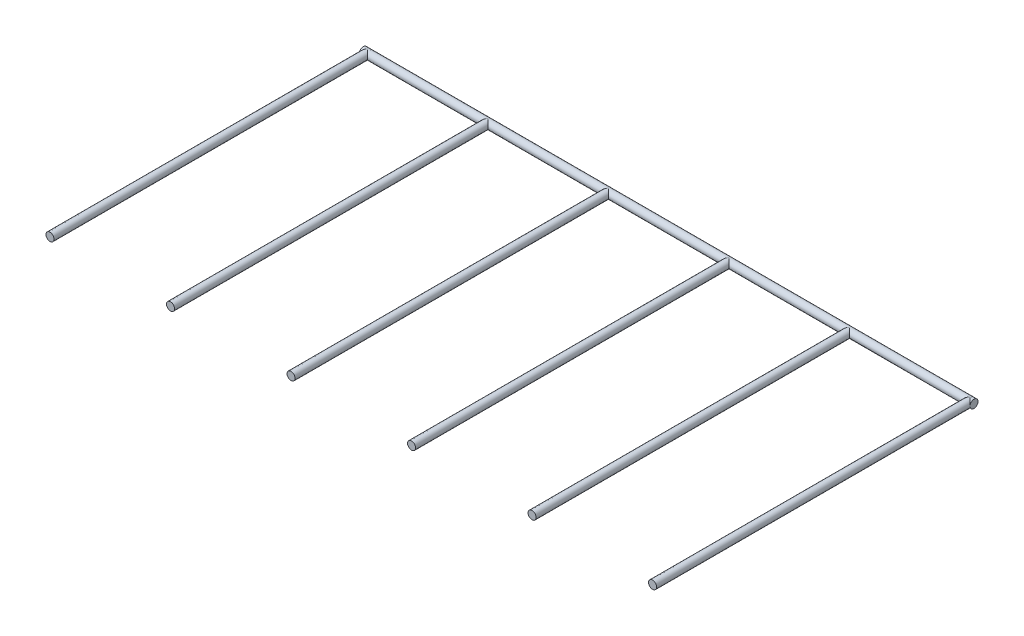
ISO-10303-21;
HEADER;
FILE_DESCRIPTION(('STEP AP214'),'2;1');
FILE_NAME('part.step','',(''),(''),'','','');
FILE_SCHEMA(('AUTOMOTIVE_DESIGN { 1 0 10303 214 1 1 1 1 }'));
ENDSEC;
DATA;
#1=APPLICATION_CONTEXT('core data for automotive mechanical design processes');
#2=APPLICATION_PROTOCOL_DEFINITION('international standard','automotive_design',2000,#1);
#3=PRODUCT_CONTEXT('',#1,'mechanical');
#4=PRODUCT('Part','Part','',(#3));
#5=PRODUCT_RELATED_PRODUCT_CATEGORY('part','',(#4));
#6=PRODUCT_DEFINITION_FORMATION('','',#4);
#7=PRODUCT_DEFINITION_CONTEXT('part definition',#1,'design');
#8=PRODUCT_DEFINITION('design','',#6,#7);
#9=PRODUCT_DEFINITION_SHAPE('','',#8);
#10=(LENGTH_UNIT() NAMED_UNIT(*) SI_UNIT(.MILLI.,.METRE.));
#11=(NAMED_UNIT(*) PLANE_ANGLE_UNIT() SI_UNIT($,.RADIAN.));
#12=(NAMED_UNIT(*) SI_UNIT($,.STERADIAN.) SOLID_ANGLE_UNIT());
#13=UNCERTAINTY_MEASURE_WITH_UNIT(LENGTH_MEASURE(1.E-05),#10,'distance_accuracy_value','');
#14=(GEOMETRIC_REPRESENTATION_CONTEXT(3) GLOBAL_UNCERTAINTY_ASSIGNED_CONTEXT((#13)) GLOBAL_UNIT_ASSIGNED_CONTEXT((#10,
#11,#12)) REPRESENTATION_CONTEXT('',''));
#15=CARTESIAN_POINT('',(0.,0.,0.));
#16=DIRECTION('',(0.,0.,1.));
#17=DIRECTION('',(1.,0.,0.));
#18=AXIS2_PLACEMENT_3D('',#15,#16,#17);
#19=CARTESIAN_POINT('',(120.65,0.,0.));
#20=DIRECTION('',(-1.,0.,0.));
#21=DIRECTION('',(0.,0.,1.));
#22=AXIS2_PLACEMENT_3D('',#19,#20,#21);
#23=CYLINDRICAL_SURFACE('',#22,1.5875);
#24=CARTESIAN_POINT('',(71.4375,0.,0.));
#25=DIRECTION('',(-0.707106781186547,0.,-0.707106781186548));
#26=DIRECTION('',(-0.707106781186547,0.,0.707106781186548));
#27=AXIS2_PLACEMENT_3D('',#24,#25,#26);
#28=ELLIPSE('',#27,2.24506403026729,1.5875);
#29=CARTESIAN_POINT('',(71.4375,1.5875,0.));
#30=VERTEX_POINT('',#29);
#31=CARTESIAN_POINT('',(71.4375,-1.5875,0.));
#32=VERTEX_POINT('',#31);
#33=EDGE_CURVE('E11',#30,#32,#28,.F.);
#34=ORIENTED_EDGE('',*,*,#33,.F.);
#35=CARTESIAN_POINT('',(71.4375,0.,0.));
#36=DIRECTION('',(-0.707106781186547,0.,0.707106781186548));
#37=DIRECTION('',(-0.707106781186547,0.,-0.707106781186548));
#38=AXIS2_PLACEMENT_3D('',#35,#36,#37);
#39=ELLIPSE('',#38,2.24506403026729,1.5875);
#40=EDGE_CURVE('E42',#32,#30,#39,.T.);
#41=ORIENTED_EDGE('',*,*,#40,.F.);
#42=EDGE_LOOP('',(#34,#41));
#43=FACE_BOUND('',#42,.T.);
#44=CARTESIAN_POINT('',(-23.8125,0.,0.));
#45=DIRECTION('',(-0.707106781186547,0.,-0.707106781186548));
#46=DIRECTION('',(-0.707106781186547,0.,0.707106781186548));
#47=AXIS2_PLACEMENT_3D('',#44,#45,#46);
#48=ELLIPSE('',#47,2.24506403026729,1.5875);
#49=CARTESIAN_POINT('',(-23.8125,1.5875,0.));
#50=VERTEX_POINT('',#49);
#51=CARTESIAN_POINT('',(-23.8124999999999,-1.5875,0.));
#52=VERTEX_POINT('',#51);
#53=EDGE_CURVE('E137',#50,#52,#48,.F.);
#54=ORIENTED_EDGE('',*,*,#53,.F.);
#55=CARTESIAN_POINT('',(-23.8125,0.,0.));
#56=DIRECTION('',(-0.707106781186547,0.,0.707106781186548));
#57=DIRECTION('',(-0.707106781186547,0.,-0.707106781186548));
#58=AXIS2_PLACEMENT_3D('',#55,#56,#57);
#59=ELLIPSE('',#58,2.24506403026729,1.5875);
#60=EDGE_CURVE('E134',#52,#50,#59,.T.);
#61=ORIENTED_EDGE('',*,*,#60,.F.);
#62=EDGE_LOOP('',(#54,#61));
#63=FACE_BOUND('',#62,.T.);
#64=CARTESIAN_POINT('',(-119.0625,0.,0.));
#65=DIRECTION('',(-0.707106781186547,0.,-0.707106781186548));
#66=DIRECTION('',(-0.707106781186547,0.,0.707106781186548));
#67=AXIS2_PLACEMENT_3D('',#64,#65,#66);
#68=ELLIPSE('',#67,2.24506403026729,1.5875);
#69=CARTESIAN_POINT('',(-119.0625,1.5875,0.));
#70=VERTEX_POINT('',#69);
#71=CARTESIAN_POINT('',(-120.65,0.,1.5875));
#72=VERTEX_POINT('',#71);
#73=EDGE_CURVE('E120',#70,#72,#68,.F.);
#74=ORIENTED_EDGE('',*,*,#73,.F.);
#75=CARTESIAN_POINT('',(-119.0625,0.,0.));
#76=DIRECTION('',(-0.707106781186547,0.,0.707106781186548));
#77=DIRECTION('',(-0.707106781186547,0.,-0.707106781186548));
#78=AXIS2_PLACEMENT_3D('',#75,#76,#77);
#79=ELLIPSE('',#78,2.24506403026729,1.5875);
#80=CARTESIAN_POINT('',(-119.0625,-1.5875,0.));
#81=VERTEX_POINT('',#80);
#82=EDGE_CURVE('E119',#81,#70,#79,.T.);
#83=ORIENTED_EDGE('',*,*,#82,.F.);
#84=EDGE_CURVE('E116',#72,#81,#68,.F.);
#85=ORIENTED_EDGE('',*,*,#84,.F.);
#86=CARTESIAN_POINT('',(-120.65,0.,0.));
#87=DIRECTION('',(1.,0.,0.));
#88=DIRECTION('',(0.,0.,-1.));
#89=AXIS2_PLACEMENT_3D('',#86,#87,#88);
#90=CIRCLE('',#89,1.5875);
#91=EDGE_CURVE('E126',#72,#72,#90,.T.);
#92=ORIENTED_EDGE('',*,*,#91,.T.);
#93=EDGE_LOOP('',(#74,#83,#85,#92));
#94=FACE_BOUND('',#93,.T.);
#95=CARTESIAN_POINT('',(-71.4375,0.,0.));
#96=DIRECTION('',(-0.707106781186547,0.,-0.707106781186548));
#97=DIRECTION('',(-0.707106781186547,0.,0.707106781186548));
#98=AXIS2_PLACEMENT_3D('',#95,#96,#97);
#99=ELLIPSE('',#98,2.24506403026729,1.5875);
#100=CARTESIAN_POINT('',(-71.4375,1.5875,0.));
#101=VERTEX_POINT('',#100);
#102=CARTESIAN_POINT('',(-71.4374999999999,-1.5875,0.));
#103=VERTEX_POINT('',#102);
#104=EDGE_CURVE('E131',#101,#103,#99,.F.);
#105=ORIENTED_EDGE('',*,*,#104,.F.);
#106=CARTESIAN_POINT('',(-71.4375,0.,0.));
#107=DIRECTION('',(-0.707106781186547,0.,0.707106781186548));
#108=DIRECTION('',(-0.707106781186547,0.,-0.707106781186548));
#109=AXIS2_PLACEMENT_3D('',#106,#107,#108);
#110=ELLIPSE('',#109,2.24506403026729,1.5875);
#111=EDGE_CURVE('E125',#103,#101,#110,.T.);
#112=ORIENTED_EDGE('',*,*,#111,.F.);
#113=EDGE_LOOP('',(#105,#112));
#114=FACE_BOUND('',#113,.T.);
#115=CARTESIAN_POINT('',(23.8125,0.,0.));
#116=DIRECTION('',(-0.707106781186547,0.,-0.707106781186548));
#117=DIRECTION('',(-0.707106781186547,0.,0.707106781186548));
#118=AXIS2_PLACEMENT_3D('',#115,#116,#117);
#119=ELLIPSE('',#118,2.24506403026729,1.5875);
#120=CARTESIAN_POINT('',(23.8125,1.5875,0.));
#121=VERTEX_POINT('',#120);
#122=CARTESIAN_POINT('',(23.8125,-1.5875,0.));
#123=VERTEX_POINT('',#122);
#124=EDGE_CURVE('E143',#121,#123,#119,.F.);
#125=ORIENTED_EDGE('',*,*,#124,.F.);
#126=CARTESIAN_POINT('',(23.8125,0.,0.));
#127=DIRECTION('',(-0.707106781186547,0.,0.707106781186548));
#128=DIRECTION('',(-0.707106781186547,0.,-0.707106781186548));
#129=AXIS2_PLACEMENT_3D('',#126,#127,#128);
#130=ELLIPSE('',#129,2.24506403026729,1.5875);
#131=EDGE_CURVE('E140',#123,#121,#130,.T.);
#132=ORIENTED_EDGE('',*,*,#131,.F.);
#133=EDGE_LOOP('',(#125,#132));
#134=FACE_BOUND('',#133,.T.);
#135=CARTESIAN_POINT('',(119.0625,0.,0.));
#136=DIRECTION('',(-0.707106781186547,0.,-0.707106781186548));
#137=DIRECTION('',(-0.707106781186547,0.,0.707106781186548));
#138=AXIS2_PLACEMENT_3D('',#135,#136,#137);
#139=ELLIPSE('',#138,2.24506403026729,1.5875);
#140=CARTESIAN_POINT('',(119.0625,1.5875,0.));
#141=VERTEX_POINT('',#140);
#142=CARTESIAN_POINT('',(119.0625,-1.5875,0.));
#143=VERTEX_POINT('',#142);
#144=EDGE_CURVE('E90',#141,#143,#139,.F.);
#145=ORIENTED_EDGE('',*,*,#144,.F.);
#146=CARTESIAN_POINT('',(119.0625,0.,0.));
#147=DIRECTION('',(-0.707106781186547,0.,0.707106781186548));
#148=DIRECTION('',(-0.707106781186547,0.,-0.707106781186548));
#149=AXIS2_PLACEMENT_3D('',#146,#147,#148);
#150=ELLIPSE('',#149,2.24506403026729,1.5875);
#151=CARTESIAN_POINT('',(120.65,0.,1.5875));
#152=VERTEX_POINT('',#151);
#153=EDGE_CURVE('E54',#152,#141,#150,.T.);
#154=ORIENTED_EDGE('',*,*,#153,.F.);
#155=CARTESIAN_POINT('',(120.65,0.,0.));
#156=DIRECTION('',(1.,0.,0.));
#157=DIRECTION('',(0.,0.,-1.));
#158=AXIS2_PLACEMENT_3D('',#155,#156,#157);
#159=CIRCLE('',#158,1.5875);
#160=EDGE_CURVE('E123',#152,#152,#159,.T.);
#161=ORIENTED_EDGE('',*,*,#160,.F.);
#162=EDGE_CURVE('E49',#143,#152,#150,.T.);
#163=ORIENTED_EDGE('',*,*,#162,.F.);
#164=EDGE_LOOP('',(#145,#154,#161,#163));
#165=FACE_BOUND('',#164,.T.);
#166=ADVANCED_FACE('F35',(#43,#63,#94,#114,#134,#165),#23,.T.);
#167=CARTESIAN_POINT('',(120.65,0.,0.));
#168=DIRECTION('',(1.,0.,0.));
#169=DIRECTION('',(0.,0.,-1.));
#170=AXIS2_PLACEMENT_3D('',#167,#168,#169);
#171=PLANE('',#170);
#172=ORIENTED_EDGE('',*,*,#160,.T.);
#173=EDGE_LOOP('',(#172));
#174=FACE_BOUND('',#173,.T.);
#175=ADVANCED_FACE('F151',(#174),#171,.T.);
#176=CARTESIAN_POINT('',(-120.65,0.,0.));
#177=DIRECTION('',(1.,0.,0.));
#178=DIRECTION('',(0.,0.,-1.));
#179=AXIS2_PLACEMENT_3D('',#176,#177,#178);
#180=PLANE('',#179);
#181=ORIENTED_EDGE('',*,*,#91,.F.);
#182=EDGE_LOOP('',(#181));
#183=FACE_BOUND('',#182,.T.);
#184=ADVANCED_FACE('F193',(#183),#180,.F.);
#185=CARTESIAN_POINT('',(-119.0625,0.,125.4125));
#186=DIRECTION('',(0.,0.,-1.));
#187=DIRECTION('',(-1.,0.,0.));
#188=AXIS2_PLACEMENT_3D('',#185,#186,#187);
#189=CYLINDRICAL_SURFACE('',#188,1.5875);
#190=CARTESIAN_POINT('',(-119.0625,0.,125.4125));
#191=DIRECTION('',(0.,0.,1.));
#192=DIRECTION('',(1.,0.,0.));
#193=AXIS2_PLACEMENT_3D('',#190,#191,#192);
#194=CIRCLE('',#193,1.5875);
#195=CARTESIAN_POINT('',(-117.475,0.,125.4125));
#196=VERTEX_POINT('',#195);
#197=EDGE_CURVE('E113',#196,#196,#194,.T.);
#198=ORIENTED_EDGE('',*,*,#197,.F.);
#199=EDGE_LOOP('',(#198));
#200=FACE_BOUND('',#199,.T.);
#201=ORIENTED_EDGE('',*,*,#82,.T.);
#202=ORIENTED_EDGE('',*,*,#73,.T.);
#203=ORIENTED_EDGE('',*,*,#84,.T.);
#204=EDGE_LOOP('',(#201,#202,#203));
#205=FACE_BOUND('',#204,.T.);
#206=ADVANCED_FACE('F189',(#200,#205),#189,.T.);
#207=CARTESIAN_POINT('',(-119.0625,0.,125.4125));
#208=DIRECTION('',(0.,0.,1.));
#209=DIRECTION('',(1.,0.,0.));
#210=AXIS2_PLACEMENT_3D('',#207,#208,#209);
#211=PLANE('',#210);
#212=ORIENTED_EDGE('',*,*,#197,.T.);
#213=EDGE_LOOP('',(#212));
#214=FACE_BOUND('',#213,.T.);
#215=ADVANCED_FACE('F185',(#214),#211,.T.);
#216=CARTESIAN_POINT('',(-71.4375,0.,125.4125));
#217=DIRECTION('',(0.,0.,-1.));
#218=DIRECTION('',(-1.,0.,0.));
#219=AXIS2_PLACEMENT_3D('',#216,#217,#218);
#220=CYLINDRICAL_SURFACE('',#219,1.5875);
#221=CARTESIAN_POINT('',(-71.4375,0.,125.4125));
#222=DIRECTION('',(0.,0.,1.));
#223=DIRECTION('',(1.,0.,0.));
#224=AXIS2_PLACEMENT_3D('',#221,#222,#223);
#225=CIRCLE('',#224,1.5875);
#226=CARTESIAN_POINT('',(-69.85,0.,125.4125));
#227=VERTEX_POINT('',#226);
#228=EDGE_CURVE('E110',#227,#227,#225,.T.);
#229=ORIENTED_EDGE('',*,*,#228,.F.);
#230=EDGE_LOOP('',(#229));
#231=FACE_BOUND('',#230,.T.);
#232=ORIENTED_EDGE('',*,*,#111,.T.);
#233=ORIENTED_EDGE('',*,*,#104,.T.);
#234=EDGE_LOOP('',(#232,#233));
#235=FACE_BOUND('',#234,.T.);
#236=ADVANCED_FACE('F181',(#231,#235),#220,.T.);
#237=CARTESIAN_POINT('',(-71.4375,0.,125.4125));
#238=DIRECTION('',(0.,0.,1.));
#239=DIRECTION('',(1.,0.,0.));
#240=AXIS2_PLACEMENT_3D('',#237,#238,#239);
#241=PLANE('',#240);
#242=ORIENTED_EDGE('',*,*,#228,.T.);
#243=EDGE_LOOP('',(#242));
#244=FACE_BOUND('',#243,.T.);
#245=ADVANCED_FACE('F177',(#244),#241,.T.);
#246=CARTESIAN_POINT('',(-23.8125,0.,125.4125));
#247=DIRECTION('',(0.,0.,-1.));
#248=DIRECTION('',(-1.,0.,0.));
#249=AXIS2_PLACEMENT_3D('',#246,#247,#248);
#250=CYLINDRICAL_SURFACE('',#249,1.5875);
#251=CARTESIAN_POINT('',(-23.8125,0.,125.4125));
#252=DIRECTION('',(0.,0.,1.));
#253=DIRECTION('',(1.,0.,0.));
#254=AXIS2_PLACEMENT_3D('',#251,#252,#253);
#255=CIRCLE('',#254,1.5875);
#256=CARTESIAN_POINT('',(-22.225,0.,125.4125));
#257=VERTEX_POINT('',#256);
#258=EDGE_CURVE('E105',#257,#257,#255,.T.);
#259=ORIENTED_EDGE('',*,*,#258,.F.);
#260=EDGE_LOOP('',(#259));
#261=FACE_BOUND('',#260,.T.);
#262=ORIENTED_EDGE('',*,*,#60,.T.);
#263=ORIENTED_EDGE('',*,*,#53,.T.);
#264=EDGE_LOOP('',(#262,#263));
#265=FACE_BOUND('',#264,.T.);
#266=ADVANCED_FACE('F169',(#261,#265),#250,.T.);
#267=CARTESIAN_POINT('',(-23.8125,0.,125.4125));
#268=DIRECTION('',(0.,0.,1.));
#269=DIRECTION('',(1.,0.,0.));
#270=AXIS2_PLACEMENT_3D('',#267,#268,#269);
#271=PLANE('',#270);
#272=ORIENTED_EDGE('',*,*,#258,.T.);
#273=EDGE_LOOP('',(#272));
#274=FACE_BOUND('',#273,.T.);
#275=ADVANCED_FACE('F160',(#274),#271,.T.);
#276=CARTESIAN_POINT('',(23.8125,0.,125.4125));
#277=DIRECTION('',(0.,0.,-1.));
#278=DIRECTION('',(-1.,0.,0.));
#279=AXIS2_PLACEMENT_3D('',#276,#277,#278);
#280=CYLINDRICAL_SURFACE('',#279,1.5875);
#281=CARTESIAN_POINT('',(23.8125,0.,125.4125));
#282=DIRECTION('',(0.,0.,1.));
#283=DIRECTION('',(1.,0.,0.));
#284=AXIS2_PLACEMENT_3D('',#281,#282,#283);
#285=CIRCLE('',#284,1.5875);
#286=CARTESIAN_POINT('',(25.4,0.,125.4125));
#287=VERTEX_POINT('',#286);
#288=EDGE_CURVE('E100',#287,#287,#285,.T.);
#289=ORIENTED_EDGE('',*,*,#288,.F.);
#290=EDGE_LOOP('',(#289));
#291=FACE_BOUND('',#290,.T.);
#292=ORIENTED_EDGE('',*,*,#131,.T.);
#293=ORIENTED_EDGE('',*,*,#124,.T.);
#294=EDGE_LOOP('',(#292,#293));
#295=FACE_BOUND('',#294,.T.);
#296=ADVANCED_FACE('F157',(#291,#295),#280,.T.);
#297=CARTESIAN_POINT('',(23.8125,0.,125.4125));
#298=DIRECTION('',(0.,0.,1.));
#299=DIRECTION('',(1.,0.,0.));
#300=AXIS2_PLACEMENT_3D('',#297,#298,#299);
#301=PLANE('',#300);
#302=ORIENTED_EDGE('',*,*,#288,.T.);
#303=EDGE_LOOP('',(#302));
#304=FACE_BOUND('',#303,.T.);
#305=ADVANCED_FACE('F159',(#304),#301,.T.);
#306=CARTESIAN_POINT('',(71.4375,0.,125.4125));
#307=DIRECTION('',(0.,0.,-1.));
#308=DIRECTION('',(-1.,0.,0.));
#309=AXIS2_PLACEMENT_3D('',#306,#307,#308);
#310=CYLINDRICAL_SURFACE('',#309,1.5875);
#311=CARTESIAN_POINT('',(71.4375,0.,125.4125));
#312=DIRECTION('',(0.,0.,1.));
#313=DIRECTION('',(1.,0.,0.));
#314=AXIS2_PLACEMENT_3D('',#311,#312,#313);
#315=CIRCLE('',#314,1.5875);
#316=CARTESIAN_POINT('',(73.025,0.,125.4125));
#317=VERTEX_POINT('',#316);
#318=EDGE_CURVE('E98',#317,#317,#315,.T.);
#319=ORIENTED_EDGE('',*,*,#318,.F.);
#320=EDGE_LOOP('',(#319));
#321=FACE_BOUND('',#320,.T.);
#322=ORIENTED_EDGE('',*,*,#40,.T.);
#323=ORIENTED_EDGE('',*,*,#33,.T.);
#324=EDGE_LOOP('',(#322,#323));
#325=FACE_BOUND('',#324,.T.);
#326=ADVANCED_FACE('F147',(#321,#325),#310,.T.);
#327=CARTESIAN_POINT('',(71.4375,0.,125.4125));
#328=DIRECTION('',(0.,0.,1.));
#329=DIRECTION('',(1.,0.,0.));
#330=AXIS2_PLACEMENT_3D('',#327,#328,#329);
#331=PLANE('',#330);
#332=ORIENTED_EDGE('',*,*,#318,.T.);
#333=EDGE_LOOP('',(#332));
#334=FACE_BOUND('',#333,.T.);
#335=ADVANCED_FACE('F249',(#334),#331,.T.);
#336=CARTESIAN_POINT('',(119.0625,0.,125.4125));
#337=DIRECTION('',(0.,0.,-1.));
#338=DIRECTION('',(-1.,0.,0.));
#339=AXIS2_PLACEMENT_3D('',#336,#337,#338);
#340=CYLINDRICAL_SURFACE('',#339,1.5875);
#341=CARTESIAN_POINT('',(119.0625,0.,125.4125));
#342=DIRECTION('',(0.,0.,1.));
#343=DIRECTION('',(1.,0.,0.));
#344=AXIS2_PLACEMENT_3D('',#341,#342,#343);
#345=CIRCLE('',#344,1.5875);
#346=CARTESIAN_POINT('',(120.65,0.,125.4125));
#347=VERTEX_POINT('',#346);
#348=EDGE_CURVE('E94',#347,#347,#345,.T.);
#349=ORIENTED_EDGE('',*,*,#348,.F.);
#350=EDGE_LOOP('',(#349));
#351=FACE_BOUND('',#350,.T.);
#352=ORIENTED_EDGE('',*,*,#144,.T.);
#353=ORIENTED_EDGE('',*,*,#162,.T.);
#354=ORIENTED_EDGE('',*,*,#153,.T.);
#355=EDGE_LOOP('',(#352,#353,#354));
#356=FACE_BOUND('',#355,.T.);
#357=ADVANCED_FACE('F93',(#351,#356),#340,.T.);
#358=CARTESIAN_POINT('',(119.0625,0.,125.4125));
#359=DIRECTION('',(0.,0.,1.));
#360=DIRECTION('',(1.,0.,0.));
#361=AXIS2_PLACEMENT_3D('',#358,#359,#360);
#362=PLANE('',#361);
#363=ORIENTED_EDGE('',*,*,#348,.T.);
#364=EDGE_LOOP('',(#363));
#365=FACE_BOUND('',#364,.T.);
#366=ADVANCED_FACE('F266',(#365),#362,.T.);
#367=CLOSED_SHELL('',(#166,#175,#184,#206,#215,#236,#245,#266,#275,#296,#305,#326,#335,#357,#366));
#368=MANIFOLD_SOLID_BREP('B2',#367);
#369=ADVANCED_BREP_SHAPE_REPRESENTATION('',(#18,#368),#14);
#370=SHAPE_DEFINITION_REPRESENTATION(#9,#369);
ENDSEC;
END-ISO-10303-21;
